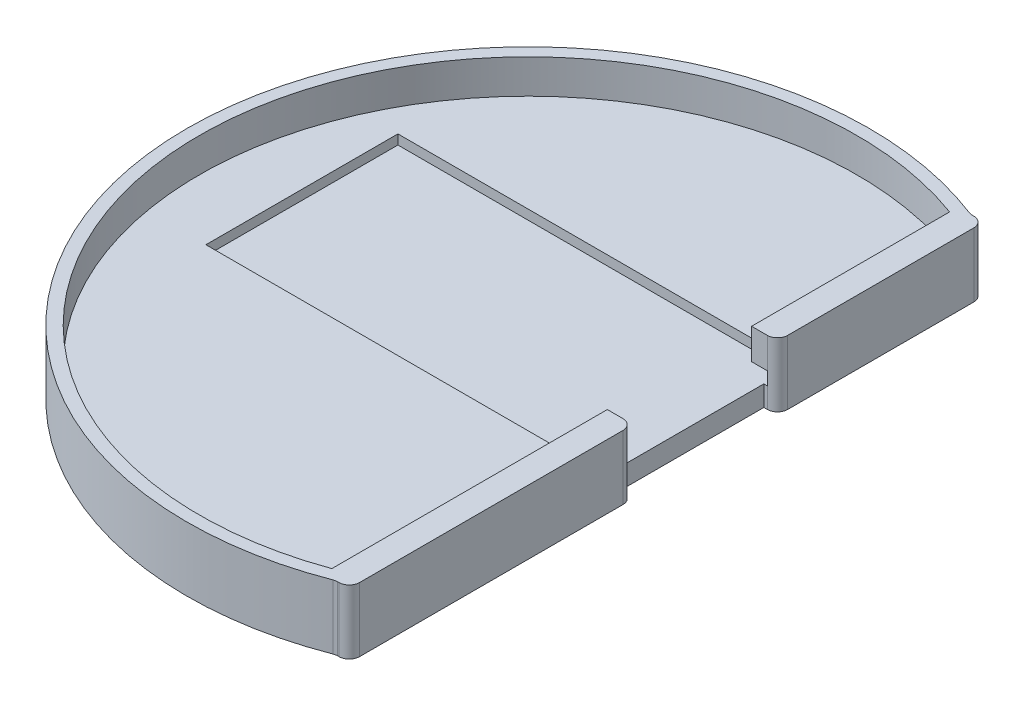
ISO-10303-21;
HEADER;
FILE_DESCRIPTION(('STEP AP214'),'2;1');
FILE_NAME('part.step','',(''),(''),'','','');
FILE_SCHEMA(('AUTOMOTIVE_DESIGN { 1 0 10303 214 1 1 1 1 }'));
ENDSEC;
DATA;
#1=APPLICATION_CONTEXT('core data for automotive mechanical design processes');
#2=APPLICATION_PROTOCOL_DEFINITION('international standard','automotive_design',2000,#1);
#3=PRODUCT_CONTEXT('',#1,'mechanical');
#4=PRODUCT('Part','Part','',(#3));
#5=PRODUCT_RELATED_PRODUCT_CATEGORY('part','',(#4));
#6=PRODUCT_DEFINITION_FORMATION('','',#4);
#7=PRODUCT_DEFINITION_CONTEXT('part definition',#1,'design');
#8=PRODUCT_DEFINITION('design','',#6,#7);
#9=PRODUCT_DEFINITION_SHAPE('','',#8);
#10=(LENGTH_UNIT() NAMED_UNIT(*) SI_UNIT(.MILLI.,.METRE.));
#11=(NAMED_UNIT(*) PLANE_ANGLE_UNIT() SI_UNIT($,.RADIAN.));
#12=(NAMED_UNIT(*) SI_UNIT($,.STERADIAN.) SOLID_ANGLE_UNIT());
#13=UNCERTAINTY_MEASURE_WITH_UNIT(LENGTH_MEASURE(1.E-05),#10,'distance_accuracy_value','');
#14=(GEOMETRIC_REPRESENTATION_CONTEXT(3) GLOBAL_UNCERTAINTY_ASSIGNED_CONTEXT((#13)) GLOBAL_UNIT_ASSIGNED_CONTEXT((#10,
#11,#12)) REPRESENTATION_CONTEXT('',''));
#15=CARTESIAN_POINT('',(0.,0.,0.));
#16=DIRECTION('',(0.,0.,1.));
#17=DIRECTION('',(1.,0.,0.));
#18=AXIS2_PLACEMENT_3D('',#15,#16,#17);
#19=CARTESIAN_POINT('',(0.,0.,-16.25));
#20=DIRECTION('',(0.,0.,1.));
#21=DIRECTION('',(1.,0.,0.));
#22=AXIS2_PLACEMENT_3D('',#19,#20,#21);
#23=PLANE('',#22);
#24=DIRECTION('',(-1.,0.,0.));
#25=VECTOR('',#24,1.);
#26=CARTESIAN_POINT('',(20.31,-1.5,-16.25));
#27=LINE('',#26,#25);
#28=CARTESIAN_POINT('',(18.81,-1.5,-16.25));
#29=VERTEX_POINT('',#28);
#30=CARTESIAN_POINT('',(18.31,-1.5,-16.25));
#31=VERTEX_POINT('',#30);
#32=EDGE_CURVE('E309',#29,#31,#27,.T.);
#33=ORIENTED_EDGE('',*,*,#32,.F.);
#34=DIRECTION('',(0.,-1.,0.));
#35=VECTOR('',#34,1.);
#36=CARTESIAN_POINT('',(18.81,0.,-16.25));
#37=LINE('',#36,#35);
#38=CARTESIAN_POINT('',(18.81,1.5,-16.25));
#39=VERTEX_POINT('',#38);
#40=EDGE_CURVE('E471',#29,#39,#37,.F.);
#41=ORIENTED_EDGE('',*,*,#40,.T.);
#42=DIRECTION('',(1.,0.,0.));
#43=VECTOR('',#42,1.);
#44=CARTESIAN_POINT('',(0.,1.5,-16.25));
#45=LINE('',#44,#43);
#46=CARTESIAN_POINT('',(18.31,1.5,-16.25));
#47=VERTEX_POINT('',#46);
#48=EDGE_CURVE('E235',#47,#39,#45,.T.);
#49=ORIENTED_EDGE('',*,*,#48,.F.);
#50=DIRECTION('',(0.,-1.,0.));
#51=VECTOR('',#50,1.);
#52=CARTESIAN_POINT('',(18.31,7.915,-16.25));
#53=LINE('',#52,#51);
#54=EDGE_CURVE('E282',#47,#31,#53,.T.);
#55=ORIENTED_EDGE('',*,*,#54,.T.);
#56=EDGE_LOOP('',(#33,#41,#49,#55));
#57=FACE_BOUND('',#56,.T.);
#58=ADVANCED_FACE('F42',(#57),#23,.T.);
#59=CARTESIAN_POINT('',(0.,0.,4.9));
#60=DIRECTION('',(0.,0.,-1.));
#61=DIRECTION('',(-1.,0.,0.));
#62=AXIS2_PLACEMENT_3D('',#59,#60,#61);
#63=PLANE('',#62);
#64=DIRECTION('',(1.,0.,0.));
#65=VECTOR('',#64,1.);
#66=CARTESIAN_POINT('',(18.31,7.915,4.9));
#67=LINE('',#66,#65);
#68=CARTESIAN_POINT('',(16.51,7.915,4.9));
#69=VERTEX_POINT('',#68);
#70=CARTESIAN_POINT('',(18.81,7.915,4.9));
#71=VERTEX_POINT('',#70);
#72=EDGE_CURVE('E320',#69,#71,#67,.T.);
#73=ORIENTED_EDGE('',*,*,#72,.T.);
#74=DIRECTION('',(0.,1.,0.));
#75=VECTOR('',#74,1.);
#76=CARTESIAN_POINT('',(18.81,-1.5,4.9));
#77=LINE('',#76,#75);
#78=CARTESIAN_POINT('',(18.81,3.415,4.9));
#79=VERTEX_POINT('',#78);
#80=EDGE_CURVE('E446',#71,#79,#77,.F.);
#81=ORIENTED_EDGE('',*,*,#80,.T.);
#82=DIRECTION('',(-1.,0.,0.));
#83=VECTOR('',#82,1.);
#84=CARTESIAN_POINT('',(18.31,3.415,4.9));
#85=LINE('',#84,#83);
#86=CARTESIAN_POINT('',(16.51,3.415,4.9));
#87=VERTEX_POINT('',#86);
#88=EDGE_CURVE('E313',#79,#87,#85,.T.);
#89=ORIENTED_EDGE('',*,*,#88,.T.);
#90=DIRECTION('',(0.,1.,0.));
#91=VECTOR('',#90,1.);
#92=CARTESIAN_POINT('',(16.51,7.915,4.9));
#93=LINE('',#92,#91);
#94=EDGE_CURVE('E316',#87,#69,#93,.T.);
#95=ORIENTED_EDGE('',*,*,#94,.T.);
#96=EDGE_LOOP('',(#73,#81,#89,#95));
#97=FACE_BOUND('',#96,.T.);
#98=ADVANCED_FACE('F529',(#97),#63,.T.);
#99=CARTESIAN_POINT('',(18.31,7.915,-46.5268084011788));
#100=DIRECTION('',(-1.,0.,0.));
#101=DIRECTION('',(0.,0.,1.));
#102=AXIS2_PLACEMENT_3D('',#99,#100,#101);
#103=PLANE('',#102);
#104=DIRECTION('',(0.,1.,0.));
#105=VECTOR('',#104,1.);
#106=CARTESIAN_POINT('',(18.31,7.915,4.9));
#107=LINE('',#106,#105);
#108=CARTESIAN_POINT('',(18.31,-1.5,4.9));
#109=VERTEX_POINT('',#108);
#110=CARTESIAN_POINT('',(18.31,1.5,4.9));
#111=VERTEX_POINT('',#110);
#112=EDGE_CURVE('E278',#109,#111,#107,.T.);
#113=ORIENTED_EDGE('',*,*,#112,.F.);
#114=DIRECTION('',(0.,0.,1.));
#115=VECTOR('',#114,1.);
#116=CARTESIAN_POINT('',(18.31,-1.5,46.5268084011788));
#117=LINE('',#116,#115);
#118=EDGE_CURVE('E346',#31,#109,#117,.T.);
#119=ORIENTED_EDGE('',*,*,#118,.F.);
#120=ORIENTED_EDGE('',*,*,#54,.F.);
#121=DIRECTION('',(0.,0.,1.));
#122=VECTOR('',#121,1.);
#123=CARTESIAN_POINT('',(18.31,1.5,0.));
#124=LINE('',#123,#122);
#125=EDGE_CURVE('E227',#47,#111,#124,.T.);
#126=ORIENTED_EDGE('',*,*,#125,.T.);
#127=EDGE_LOOP('',(#113,#119,#120,#126));
#128=FACE_BOUND('',#127,.T.);
#129=ADVANCED_FACE('F587',(#128),#103,.F.);
#130=CARTESIAN_POINT('',(-38.84,2.915,8.4));
#131=DIRECTION('',(0.,0.,-1.));
#132=DIRECTION('',(-1.,0.,0.));
#133=AXIS2_PLACEMENT_3D('',#130,#131,#132);
#134=PLANE('',#133);
#135=DIRECTION('',(0.,-1.,0.));
#136=VECTOR('',#135,1.);
#137=CARTESIAN_POINT('',(16.51,7.915,8.4));
#138=LINE('',#137,#136);
#139=CARTESIAN_POINT('',(16.51,3.415,8.4));
#140=VERTEX_POINT('',#139);
#141=CARTESIAN_POINT('',(16.51,2.915,8.4));
#142=VERTEX_POINT('',#141);
#143=EDGE_CURVE('E381',#140,#142,#138,.T.);
#144=ORIENTED_EDGE('',*,*,#143,.F.);
#145=DIRECTION('',(-1.,0.,0.));
#146=VECTOR('',#145,1.);
#147=CARTESIAN_POINT('',(18.31,3.415,8.4));
#148=LINE('',#147,#146);
#149=CARTESIAN_POINT('',(18.81,3.415,8.4));
#150=VERTEX_POINT('',#149);
#151=EDGE_CURVE('E312',#150,#140,#148,.T.);
#152=ORIENTED_EDGE('',*,*,#151,.F.);
#153=DIRECTION('',(0.,1.,0.));
#154=VECTOR('',#153,1.);
#155=CARTESIAN_POINT('',(18.81,1.5,8.4));
#156=LINE('',#155,#154);
#157=CARTESIAN_POINT('',(18.81,1.5,8.4));
#158=VERTEX_POINT('',#157);
#159=EDGE_CURVE('E240',#158,#150,#156,.T.);
#160=ORIENTED_EDGE('',*,*,#159,.F.);
#161=DIRECTION('',(-1.,0.,0.));
#162=VECTOR('',#161,1.);
#163=CARTESIAN_POINT('',(0.,1.5,8.4));
#164=LINE('',#163,#162);
#165=CARTESIAN_POINT('',(-38.84,1.5,8.4));
#166=VERTEX_POINT('',#165);
#167=EDGE_CURVE('E413',#158,#166,#164,.T.);
#168=ORIENTED_EDGE('',*,*,#167,.T.);
#169=DIRECTION('',(0.,-1.,0.));
#170=VECTOR('',#169,1.);
#171=CARTESIAN_POINT('',(-38.84,2.915,8.4));
#172=LINE('',#171,#170);
#173=CARTESIAN_POINT('',(-38.84,2.915,8.4));
#174=VERTEX_POINT('',#173);
#175=EDGE_CURVE('E403',#174,#166,#172,.T.);
#176=ORIENTED_EDGE('',*,*,#175,.F.);
#177=DIRECTION('',(1.,0.,0.));
#178=VECTOR('',#177,1.);
#179=CARTESIAN_POINT('',(-38.84,2.915,8.4));
#180=LINE('',#179,#178);
#181=EDGE_CURVE('E394',#174,#142,#180,.T.);
#182=ORIENTED_EDGE('',*,*,#181,.T.);
#183=EDGE_LOOP('',(#144,#152,#160,#168,#176,#182));
#184=FACE_BOUND('',#183,.T.);
#185=ADVANCED_FACE('F610',(#184),#134,.T.);
#186=CARTESIAN_POINT('',(-38.84,2.915,-19.75));
#187=DIRECTION('',(0.,0.,1.));
#188=DIRECTION('',(1.,0.,0.));
#189=AXIS2_PLACEMENT_3D('',#186,#187,#188);
#190=PLANE('',#189);
#191=DIRECTION('',(1.,0.,0.));
#192=VECTOR('',#191,1.);
#193=CARTESIAN_POINT('',(0.,1.5,-19.75));
#194=LINE('',#193,#192);
#195=CARTESIAN_POINT('',(-38.84,1.5,-19.75));
#196=VERTEX_POINT('',#195);
#197=CARTESIAN_POINT('',(18.81,1.5,-19.75));
#198=VERTEX_POINT('',#197);
#199=EDGE_CURVE('E216',#196,#198,#194,.T.);
#200=ORIENTED_EDGE('',*,*,#199,.T.);
#201=DIRECTION('',(0.,-1.,0.));
#202=VECTOR('',#201,1.);
#203=CARTESIAN_POINT('',(18.81,1.5,-19.75));
#204=LINE('',#203,#202);
#205=CARTESIAN_POINT('',(18.81,3.415,-19.75));
#206=VERTEX_POINT('',#205);
#207=EDGE_CURVE('E221',#206,#198,#204,.T.);
#208=ORIENTED_EDGE('',*,*,#207,.F.);
#209=DIRECTION('',(1.,0.,0.));
#210=VECTOR('',#209,1.);
#211=CARTESIAN_POINT('',(16.51,3.415,-19.75));
#212=LINE('',#211,#210);
#213=CARTESIAN_POINT('',(16.51,3.415,-19.75));
#214=VERTEX_POINT('',#213);
#215=EDGE_CURVE('E330',#214,#206,#212,.T.);
#216=ORIENTED_EDGE('',*,*,#215,.F.);
#217=DIRECTION('',(0.,-1.,0.));
#218=VECTOR('',#217,1.);
#219=CARTESIAN_POINT('',(16.51,7.915,-19.75));
#220=LINE('',#219,#218);
#221=CARTESIAN_POINT('',(16.51,2.915,-19.75));
#222=VERTEX_POINT('',#221);
#223=EDGE_CURVE('E384',#214,#222,#220,.T.);
#224=ORIENTED_EDGE('',*,*,#223,.T.);
#225=DIRECTION('',(-1.,0.,0.));
#226=VECTOR('',#225,1.);
#227=CARTESIAN_POINT('',(-38.84,2.915,-19.75));
#228=LINE('',#227,#226);
#229=CARTESIAN_POINT('',(-38.84,2.915,-19.75));
#230=VERTEX_POINT('',#229);
#231=EDGE_CURVE('E398',#222,#230,#228,.T.);
#232=ORIENTED_EDGE('',*,*,#231,.T.);
#233=DIRECTION('',(0.,-1.,0.));
#234=VECTOR('',#233,1.);
#235=CARTESIAN_POINT('',(-38.84,2.915,-19.75));
#236=LINE('',#235,#234);
#237=EDGE_CURVE('E223',#230,#196,#236,.T.);
#238=ORIENTED_EDGE('',*,*,#237,.T.);
#239=EDGE_LOOP('',(#200,#208,#216,#224,#232,#238));
#240=FACE_BOUND('',#239,.T.);
#241=ADVANCED_FACE('F218',(#240),#190,.T.);
#242=CARTESIAN_POINT('',(0.,1.5,0.));
#243=DIRECTION('',(0.,-1.,0.));
#244=DIRECTION('',(0.,0.,-1.));
#245=AXIS2_PLACEMENT_3D('',#242,#243,#244);
#246=CYLINDRICAL_SURFACE('',#245,50.);
#247=CARTESIAN_POINT('',(0.,7.915,0.));
#248=DIRECTION('',(0.,1.,0.));
#249=DIRECTION('',(0.,0.,1.));
#250=AXIS2_PLACEMENT_3D('',#247,#248,#249);
#251=CIRCLE('',#250,50.);
#252=CARTESIAN_POINT('',(18.0508303673321,7.915,-46.6279693215328));
#253=VERTEX_POINT('',#252);
#254=CARTESIAN_POINT('',(18.0508303673321,7.915,46.6279693215328));
#255=VERTEX_POINT('',#254);
#256=EDGE_CURVE('E360',#253,#255,#251,.T.);
#257=ORIENTED_EDGE('',*,*,#256,.F.);
#258=DIRECTION('',(0.,-1.,0.));
#259=VECTOR('',#258,1.);
#260=CARTESIAN_POINT('',(18.0508303673321,1.5,-46.6279693215328));
#261=LINE('',#260,#259);
#262=CARTESIAN_POINT('',(18.0508303673321,-1.5,-46.6279693215328));
#263=VERTEX_POINT('',#262);
#264=EDGE_CURVE('E483',#253,#263,#261,.T.);
#265=ORIENTED_EDGE('',*,*,#264,.T.);
#266=CARTESIAN_POINT('',(0.,-1.5,0.));
#267=DIRECTION('',(0.,1.,0.));
#268=DIRECTION('',(0.,0.,1.));
#269=AXIS2_PLACEMENT_3D('',#266,#267,#268);
#270=CIRCLE('',#269,50.);
#271=CARTESIAN_POINT('',(18.0508303673321,-1.5,46.6279693215328));
#272=VERTEX_POINT('',#271);
#273=EDGE_CURVE('E228',#263,#272,#270,.T.);
#274=ORIENTED_EDGE('',*,*,#273,.T.);
#275=DIRECTION('',(0.,-1.,0.));
#276=VECTOR('',#275,1.);
#277=CARTESIAN_POINT('',(18.0508303673321,1.5,46.6279693215328));
#278=LINE('',#277,#276);
#279=EDGE_CURVE('E480',#272,#255,#278,.F.);
#280=ORIENTED_EDGE('',*,*,#279,.T.);
#281=EDGE_LOOP('',(#257,#265,#274,#280));
#282=FACE_BOUND('',#281,.T.);
#283=ADVANCED_FACE('F504',(#282),#246,.T.);
#284=CARTESIAN_POINT('',(0.,-1.5,0.));
#285=DIRECTION('',(0.,1.,0.));
#286=DIRECTION('',(0.,0.,1.));
#287=AXIS2_PLACEMENT_3D('',#284,#285,#286);
#288=PLANE('',#287);
#289=DIRECTION('',(-1.,0.,0.));
#290=VECTOR('',#289,1.);
#291=CARTESIAN_POINT('',(20.31,-1.5,4.9));
#292=LINE('',#291,#290);
#293=CARTESIAN_POINT('',(18.81,-1.5,4.9));
#294=VERTEX_POINT('',#293);
#295=EDGE_CURVE('E274',#294,#109,#292,.T.);
#296=ORIENTED_EDGE('',*,*,#295,.F.);
#297=CARTESIAN_POINT('',(18.81,-1.5,6.4));
#298=DIRECTION('',(0.,1.,0.));
#299=DIRECTION('',(0.,0.,1.));
#300=AXIS2_PLACEMENT_3D('',#297,#298,#299);
#301=CIRCLE('',#300,1.5);
#302=CARTESIAN_POINT('',(20.31,-1.5,6.4));
#303=VERTEX_POINT('',#302);
#304=EDGE_CURVE('E457',#294,#303,#301,.F.);
#305=ORIENTED_EDGE('',*,*,#304,.T.);
#306=DIRECTION('',(0.,0.,-1.));
#307=VECTOR('',#306,1.);
#308=CARTESIAN_POINT('',(20.31,-1.5,4.9));
#309=LINE('',#308,#307);
#310=CARTESIAN_POINT('',(20.31,-1.5,45.0268084011788));
#311=VERTEX_POINT('',#310);
#312=EDGE_CURVE('E277',#311,#303,#309,.T.);
#313=ORIENTED_EDGE('',*,*,#312,.F.);
#314=CARTESIAN_POINT('',(18.8099999999999,-1.5,45.0268084011788));
#315=DIRECTION('',(0.,1.,0.));
#316=DIRECTION('',(0.,0.,1.));
#317=AXIS2_PLACEMENT_3D('',#314,#315,#316);
#318=CIRCLE('',#317,1.5);
#319=CARTESIAN_POINT('',(18.8099999999999,-1.5,46.5268084011788));
#320=VERTEX_POINT('',#319);
#321=EDGE_CURVE('E65',#311,#320,#318,.F.);
#322=ORIENTED_EDGE('',*,*,#321,.T.);
#323=DIRECTION('',(-1.,0.,0.));
#324=VECTOR('',#323,1.);
#325=CARTESIAN_POINT('',(20.31,-1.5,46.5268084011788));
#326=LINE('',#325,#324);
#327=CARTESIAN_POINT('',(18.592355278352,-1.5,46.5268084011788));
#328=VERTEX_POINT('',#327);
#329=EDGE_CURVE('E271',#320,#328,#326,.T.);
#330=ORIENTED_EDGE('',*,*,#329,.T.);
#331=CARTESIAN_POINT('',(18.592355278352,-1.5,48.0268084011788));
#332=DIRECTION('',(0.,1.,0.));
#333=DIRECTION('',(0.,0.,1.));
#334=AXIS2_PLACEMENT_3D('',#331,#332,#333);
#335=CIRCLE('',#334,1.5);
#336=EDGE_CURVE('E51',#328,#272,#335,.T.);
#337=ORIENTED_EDGE('',*,*,#336,.T.);
#338=ORIENTED_EDGE('',*,*,#273,.F.);
#339=CARTESIAN_POINT('',(18.592355278352,-1.5,-48.0268084011788));
#340=DIRECTION('',(0.,1.,0.));
#341=DIRECTION('',(0.,0.,1.));
#342=AXIS2_PLACEMENT_3D('',#339,#340,#341);
#343=CIRCLE('',#342,1.5);
#344=CARTESIAN_POINT('',(18.592355278352,-1.5,-46.5268084011788));
#345=VERTEX_POINT('',#344);
#346=EDGE_CURVE('E493',#263,#345,#343,.T.);
#347=ORIENTED_EDGE('',*,*,#346,.T.);
#348=DIRECTION('',(-1.,0.,0.));
#349=VECTOR('',#348,1.);
#350=CARTESIAN_POINT('',(20.31,-1.5,-46.5268084011788));
#351=LINE('',#350,#349);
#352=CARTESIAN_POINT('',(18.81,-1.5,-46.5268084011788));
#353=VERTEX_POINT('',#352);
#354=EDGE_CURVE('E305',#353,#345,#351,.T.);
#355=ORIENTED_EDGE('',*,*,#354,.F.);
#356=CARTESIAN_POINT('',(18.81,-1.5,-45.0268084011788));
#357=DIRECTION('',(0.,1.,0.));
#358=DIRECTION('',(0.,0.,1.));
#359=AXIS2_PLACEMENT_3D('',#356,#357,#358);
#360=CIRCLE('',#359,1.5);
#361=CARTESIAN_POINT('',(20.31,-1.5,-45.0268084011788));
#362=VERTEX_POINT('',#361);
#363=EDGE_CURVE('E451',#353,#362,#360,.F.);
#364=ORIENTED_EDGE('',*,*,#363,.T.);
#365=DIRECTION('',(0.,0.,-1.));
#366=VECTOR('',#365,1.);
#367=CARTESIAN_POINT('',(20.31,-1.5,-16.25));
#368=LINE('',#367,#366);
#369=CARTESIAN_POINT('',(20.31,-1.5,-17.75));
#370=VERTEX_POINT('',#369);
#371=EDGE_CURVE('E290',#370,#362,#368,.T.);
#372=ORIENTED_EDGE('',*,*,#371,.F.);
#373=CARTESIAN_POINT('',(18.81,-1.5,-17.75));
#374=DIRECTION('',(0.,1.,0.));
#375=DIRECTION('',(0.,0.,1.));
#376=AXIS2_PLACEMENT_3D('',#373,#374,#375);
#377=CIRCLE('',#376,1.5);
#378=EDGE_CURVE('E454',#370,#29,#377,.F.);
#379=ORIENTED_EDGE('',*,*,#378,.T.);
#380=ORIENTED_EDGE('',*,*,#32,.T.);
#381=ORIENTED_EDGE('',*,*,#118,.T.);
#382=EDGE_LOOP('',(#296,#305,#313,#322,#330,#337,#338,#347,#355,#364,#372,#379,#380,#381));
#383=FACE_BOUND('',#382,.T.);
#384=ADVANCED_FACE('F501',(#383),#288,.F.);
#385=CARTESIAN_POINT('',(0.,2.915,0.));
#386=DIRECTION('',(0.,1.,0.));
#387=DIRECTION('',(0.,0.,1.));
#388=AXIS2_PLACEMENT_3D('',#385,#386,#387);
#389=PLANE('',#388);
#390=DIRECTION('',(0.,0.,1.));
#391=VECTOR('',#390,1.);
#392=CARTESIAN_POINT('',(16.51,2.915,8.4));
#393=LINE('',#392,#391);
#394=CARTESIAN_POINT('',(16.51,2.915,45.2842124807311));
#395=VERTEX_POINT('',#394);
#396=EDGE_CURVE('E356',#142,#395,#393,.T.);
#397=ORIENTED_EDGE('',*,*,#396,.F.);
#398=ORIENTED_EDGE('',*,*,#181,.F.);
#399=DIRECTION('',(0.,0.,1.));
#400=VECTOR('',#399,1.);
#401=CARTESIAN_POINT('',(-38.84,2.915,-19.75));
#402=LINE('',#401,#400);
#403=EDGE_CURVE('E391',#230,#174,#402,.T.);
#404=ORIENTED_EDGE('',*,*,#403,.F.);
#405=ORIENTED_EDGE('',*,*,#231,.F.);
#406=DIRECTION('',(0.,0.,1.));
#407=VECTOR('',#406,1.);
#408=CARTESIAN_POINT('',(16.51,2.915,-45.2842124807311));
#409=LINE('',#408,#407);
#410=CARTESIAN_POINT('',(16.51,2.915,-45.2842124807311));
#411=VERTEX_POINT('',#410);
#412=EDGE_CURVE('E371',#411,#222,#409,.T.);
#413=ORIENTED_EDGE('',*,*,#412,.F.);
#414=CARTESIAN_POINT('',(0.,2.915,0.));
#415=DIRECTION('',(0.,-1.,0.));
#416=DIRECTION('',(0.,0.,1.));
#417=AXIS2_PLACEMENT_3D('',#414,#415,#416);
#418=CIRCLE('',#417,48.2);
#419=EDGE_CURVE('E350',#395,#411,#418,.T.);
#420=ORIENTED_EDGE('',*,*,#419,.F.);
#421=EDGE_LOOP('',(#397,#398,#404,#405,#413,#420));
#422=FACE_BOUND('',#421,.T.);
#423=ADVANCED_FACE('F624',(#422),#389,.T.);
#424=CARTESIAN_POINT('',(-38.84,2.915,-19.75));
#425=DIRECTION('',(1.,0.,0.));
#426=DIRECTION('',(0.,0.,-1.));
#427=AXIS2_PLACEMENT_3D('',#424,#425,#426);
#428=PLANE('',#427);
#429=ORIENTED_EDGE('',*,*,#175,.T.);
#430=DIRECTION('',(0.,0.,-1.));
#431=VECTOR('',#430,1.);
#432=CARTESIAN_POINT('',(-38.84,1.5,0.));
#433=LINE('',#432,#431);
#434=EDGE_CURVE('E417',#166,#196,#433,.T.);
#435=ORIENTED_EDGE('',*,*,#434,.T.);
#436=ORIENTED_EDGE('',*,*,#237,.F.);
#437=ORIENTED_EDGE('',*,*,#403,.T.);
#438=EDGE_LOOP('',(#429,#435,#436,#437));
#439=FACE_BOUND('',#438,.T.);
#440=ADVANCED_FACE('F621',(#439),#428,.T.);
#441=CARTESIAN_POINT('',(0.,1.5,0.));
#442=DIRECTION('',(0.,1.,0.));
#443=DIRECTION('',(0.,0.,1.));
#444=AXIS2_PLACEMENT_3D('',#441,#442,#443);
#445=PLANE('',#444);
#446=ORIENTED_EDGE('',*,*,#434,.F.);
#447=ORIENTED_EDGE('',*,*,#167,.F.);
#448=DIRECTION('',(0.,0.,1.));
#449=VECTOR('',#448,1.);
#450=CARTESIAN_POINT('',(18.81,1.5,-19.75));
#451=LINE('',#450,#449);
#452=CARTESIAN_POINT('',(18.81,1.5,4.9));
#453=VERTEX_POINT('',#452);
#454=EDGE_CURVE('E241',#453,#158,#451,.T.);
#455=ORIENTED_EDGE('',*,*,#454,.F.);
#456=DIRECTION('',(-1.,0.,0.));
#457=VECTOR('',#456,1.);
#458=CARTESIAN_POINT('',(0.,1.5,4.9));
#459=LINE('',#458,#457);
#460=EDGE_CURVE('E259',#453,#111,#459,.T.);
#461=ORIENTED_EDGE('',*,*,#460,.T.);
#462=ORIENTED_EDGE('',*,*,#125,.F.);
#463=ORIENTED_EDGE('',*,*,#48,.T.);
#464=EDGE_CURVE('E232',#198,#39,#451,.T.);
#465=ORIENTED_EDGE('',*,*,#464,.F.);
#466=ORIENTED_EDGE('',*,*,#199,.F.);
#467=EDGE_LOOP('',(#446,#447,#455,#461,#462,#463,#465,#466));
#468=FACE_BOUND('',#467,.T.);
#469=ADVANCED_FACE('F233',(#468),#445,.T.);
#470=CARTESIAN_POINT('',(0.,7.915,0.));
#471=DIRECTION('',(0.,-1.,0.));
#472=DIRECTION('',(0.,0.,-1.));
#473=AXIS2_PLACEMENT_3D('',#470,#471,#472);
#474=CYLINDRICAL_SURFACE('',#473,48.2);
#475=ORIENTED_EDGE('',*,*,#419,.T.);
#476=DIRECTION('',(0.,-1.,0.));
#477=VECTOR('',#476,1.);
#478=CARTESIAN_POINT('',(16.51,7.915,-45.2842124807311));
#479=LINE('',#478,#477);
#480=CARTESIAN_POINT('',(16.51,7.915,-45.2842124807311));
#481=VERTEX_POINT('',#480);
#482=EDGE_CURVE('E387',#481,#411,#479,.T.);
#483=ORIENTED_EDGE('',*,*,#482,.F.);
#484=CARTESIAN_POINT('',(0.,7.915,0.));
#485=DIRECTION('',(0.,-1.,0.));
#486=DIRECTION('',(0.,0.,1.));
#487=AXIS2_PLACEMENT_3D('',#484,#485,#486);
#488=CIRCLE('',#487,48.2);
#489=CARTESIAN_POINT('',(16.51,7.915,45.2842124807311));
#490=VERTEX_POINT('',#489);
#491=EDGE_CURVE('E351',#490,#481,#488,.T.);
#492=ORIENTED_EDGE('',*,*,#491,.F.);
#493=DIRECTION('',(0.,-1.,0.));
#494=VECTOR('',#493,1.);
#495=CARTESIAN_POINT('',(16.51,7.915,45.2842124807311));
#496=LINE('',#495,#494);
#497=EDGE_CURVE('E367',#490,#395,#496,.T.);
#498=ORIENTED_EDGE('',*,*,#497,.T.);
#499=EDGE_LOOP('',(#475,#483,#492,#498));
#500=FACE_BOUND('',#499,.T.);
#501=ADVANCED_FACE('F542',(#500),#474,.F.);
#502=CARTESIAN_POINT('',(16.51,7.915,-45.2842124807311));
#503=DIRECTION('',(1.,0.,0.));
#504=DIRECTION('',(0.,0.,-1.));
#505=AXIS2_PLACEMENT_3D('',#502,#503,#504);
#506=PLANE('',#505);
#507=ORIENTED_EDGE('',*,*,#412,.T.);
#508=ORIENTED_EDGE('',*,*,#223,.F.);
#509=DIRECTION('',(0.,0.,-1.));
#510=VECTOR('',#509,1.);
#511=CARTESIAN_POINT('',(16.51,3.415,-16.25));
#512=LINE('',#511,#510);
#513=CARTESIAN_POINT('',(16.51,3.415,-16.25));
#514=VERTEX_POINT('',#513);
#515=EDGE_CURVE('E341',#514,#214,#512,.T.);
#516=ORIENTED_EDGE('',*,*,#515,.F.);
#517=DIRECTION('',(0.,-1.,0.));
#518=VECTOR('',#517,1.);
#519=CARTESIAN_POINT('',(16.51,7.915,-16.25));
#520=LINE('',#519,#518);
#521=CARTESIAN_POINT('',(16.51,7.915,-16.25));
#522=VERTEX_POINT('',#521);
#523=EDGE_CURVE('E331',#522,#514,#520,.T.);
#524=ORIENTED_EDGE('',*,*,#523,.F.);
#525=DIRECTION('',(0.,0.,1.));
#526=VECTOR('',#525,1.);
#527=CARTESIAN_POINT('',(16.51,7.915,-45.2842124807311));
#528=LINE('',#527,#526);
#529=EDGE_CURVE('E355',#481,#522,#528,.T.);
#530=ORIENTED_EDGE('',*,*,#529,.F.);
#531=ORIENTED_EDGE('',*,*,#482,.T.);
#532=EDGE_LOOP('',(#507,#508,#516,#524,#530,#531));
#533=FACE_BOUND('',#532,.T.);
#534=ADVANCED_FACE('F544',(#533),#506,.F.);
#535=CARTESIAN_POINT('',(16.51,7.915,8.4));
#536=DIRECTION('',(1.,0.,0.));
#537=DIRECTION('',(0.,0.,-1.));
#538=AXIS2_PLACEMENT_3D('',#535,#536,#537);
#539=PLANE('',#538);
#540=ORIENTED_EDGE('',*,*,#396,.T.);
#541=ORIENTED_EDGE('',*,*,#497,.F.);
#542=DIRECTION('',(0.,0.,1.));
#543=VECTOR('',#542,1.);
#544=CARTESIAN_POINT('',(16.51,7.915,8.4));
#545=LINE('',#544,#543);
#546=EDGE_CURVE('E364',#69,#490,#545,.T.);
#547=ORIENTED_EDGE('',*,*,#546,.F.);
#548=ORIENTED_EDGE('',*,*,#94,.F.);
#549=DIRECTION('',(0.,0.,1.));
#550=VECTOR('',#549,1.);
#551=CARTESIAN_POINT('',(16.51,3.415,4.9));
#552=LINE('',#551,#550);
#553=EDGE_CURVE('E324',#87,#140,#552,.T.);
#554=ORIENTED_EDGE('',*,*,#553,.T.);
#555=ORIENTED_EDGE('',*,*,#143,.T.);
#556=EDGE_LOOP('',(#540,#541,#547,#548,#554,#555));
#557=FACE_BOUND('',#556,.T.);
#558=ADVANCED_FACE('F534',(#557),#539,.F.);
#559=CARTESIAN_POINT('',(0.,7.915,0.));
#560=DIRECTION('',(0.,1.,0.));
#561=DIRECTION('',(0.,0.,1.));
#562=AXIS2_PLACEMENT_3D('',#559,#560,#561);
#563=PLANE('',#562);
#564=DIRECTION('',(0.,0.,1.));
#565=VECTOR('',#564,1.);
#566=CARTESIAN_POINT('',(20.31,7.915,4.9));
#567=LINE('',#566,#565);
#568=CARTESIAN_POINT('',(20.31,7.915,6.4));
#569=VERTEX_POINT('',#568);
#570=CARTESIAN_POINT('',(20.31,7.915,45.0268084011788));
#571=VERTEX_POINT('',#570);
#572=EDGE_CURVE('E283',#569,#571,#567,.T.);
#573=ORIENTED_EDGE('',*,*,#572,.F.);
#574=CARTESIAN_POINT('',(18.81,7.915,6.4));
#575=DIRECTION('',(0.,1.,0.));
#576=DIRECTION('',(0.,0.,1.));
#577=AXIS2_PLACEMENT_3D('',#574,#575,#576);
#578=CIRCLE('',#577,1.5);
#579=EDGE_CURVE('E440',#569,#71,#578,.T.);
#580=ORIENTED_EDGE('',*,*,#579,.T.);
#581=ORIENTED_EDGE('',*,*,#72,.F.);
#582=ORIENTED_EDGE('',*,*,#546,.T.);
#583=ORIENTED_EDGE('',*,*,#491,.T.);
#584=ORIENTED_EDGE('',*,*,#529,.T.);
#585=DIRECTION('',(-1.,0.,0.));
#586=VECTOR('',#585,1.);
#587=CARTESIAN_POINT('',(16.51,7.915,-16.25));
#588=LINE('',#587,#586);
#589=CARTESIAN_POINT('',(18.81,7.915,-16.25));
#590=VERTEX_POINT('',#589);
#591=EDGE_CURVE('E338',#590,#522,#588,.T.);
#592=ORIENTED_EDGE('',*,*,#591,.F.);
#593=CARTESIAN_POINT('',(18.81,7.915,-17.75));
#594=DIRECTION('',(0.,1.,0.));
#595=DIRECTION('',(0.,0.,1.));
#596=AXIS2_PLACEMENT_3D('',#593,#594,#595);
#597=CIRCLE('',#596,1.5);
#598=CARTESIAN_POINT('',(20.31,7.915,-17.75));
#599=VERTEX_POINT('',#598);
#600=EDGE_CURVE('E437',#590,#599,#597,.T.);
#601=ORIENTED_EDGE('',*,*,#600,.T.);
#602=DIRECTION('',(0.,0.,1.));
#603=VECTOR('',#602,1.);
#604=CARTESIAN_POINT('',(20.31,7.915,-16.25));
#605=LINE('',#604,#603);
#606=CARTESIAN_POINT('',(20.31,7.915,-45.0268084011788));
#607=VERTEX_POINT('',#606);
#608=EDGE_CURVE('E294',#607,#599,#605,.T.);
#609=ORIENTED_EDGE('',*,*,#608,.F.);
#610=CARTESIAN_POINT('',(18.81,7.915,-45.0268084011788));
#611=DIRECTION('',(0.,1.,0.));
#612=DIRECTION('',(0.,0.,1.));
#613=AXIS2_PLACEMENT_3D('',#610,#611,#612);
#614=CIRCLE('',#613,1.5);
#615=CARTESIAN_POINT('',(18.81,7.915,-46.5268084011788));
#616=VERTEX_POINT('',#615);
#617=EDGE_CURVE('E434',#607,#616,#614,.T.);
#618=ORIENTED_EDGE('',*,*,#617,.T.);
#619=DIRECTION('',(-1.,0.,0.));
#620=VECTOR('',#619,1.);
#621=CARTESIAN_POINT('',(20.31,7.915,-46.5268084011788));
#622=LINE('',#621,#620);
#623=CARTESIAN_POINT('',(18.592355278352,7.915,-46.5268084011788));
#624=VERTEX_POINT('',#623);
#625=EDGE_CURVE('E298',#616,#624,#622,.T.);
#626=ORIENTED_EDGE('',*,*,#625,.T.);
#627=CARTESIAN_POINT('',(18.592355278352,7.915,-48.0268084011788));
#628=DIRECTION('',(0.,1.,0.));
#629=DIRECTION('',(0.,0.,1.));
#630=AXIS2_PLACEMENT_3D('',#627,#628,#629);
#631=CIRCLE('',#630,1.5);
#632=EDGE_CURVE('E496',#624,#253,#631,.F.);
#633=ORIENTED_EDGE('',*,*,#632,.T.);
#634=ORIENTED_EDGE('',*,*,#256,.T.);
#635=CARTESIAN_POINT('',(18.592355278352,7.915,48.0268084011788));
#636=DIRECTION('',(0.,1.,0.));
#637=DIRECTION('',(0.,0.,1.));
#638=AXIS2_PLACEMENT_3D('',#635,#636,#637);
#639=CIRCLE('',#638,1.5);
#640=CARTESIAN_POINT('',(18.592355278352,7.915,46.5268084011788));
#641=VERTEX_POINT('',#640);
#642=EDGE_CURVE('E11',#255,#641,#639,.F.);
#643=ORIENTED_EDGE('',*,*,#642,.T.);
#644=DIRECTION('',(-1.,0.,0.));
#645=VECTOR('',#644,1.);
#646=CARTESIAN_POINT('',(20.31,7.915,46.5268084011788));
#647=LINE('',#646,#645);
#648=CARTESIAN_POINT('',(18.8099999999999,7.915,46.5268084011788));
#649=VERTEX_POINT('',#648);
#650=EDGE_CURVE('E267',#649,#641,#647,.T.);
#651=ORIENTED_EDGE('',*,*,#650,.F.);
#652=CARTESIAN_POINT('',(18.8099999999999,7.915,45.0268084011788));
#653=DIRECTION('',(0.,1.,0.));
#654=DIRECTION('',(0.,0.,1.));
#655=AXIS2_PLACEMENT_3D('',#652,#653,#654);
#656=CIRCLE('',#655,1.5);
#657=EDGE_CURVE('E431',#649,#571,#656,.T.);
#658=ORIENTED_EDGE('',*,*,#657,.T.);
#659=EDGE_LOOP('',(#573,#580,#581,#582,#583,#584,#592,#601,#609,#618,#626,#633,#634,#643,#651,#658));
#660=FACE_BOUND('',#659,.T.);
#661=ADVANCED_FACE('F510',(#660),#563,.T.);
#662=CARTESIAN_POINT('',(16.51,3.415,-16.25));
#663=DIRECTION('',(0.,1.,0.));
#664=DIRECTION('',(0.,0.,1.));
#665=AXIS2_PLACEMENT_3D('',#662,#663,#664);
#666=PLANE('',#665);
#667=ORIENTED_EDGE('',*,*,#215,.T.);
#668=DIRECTION('',(0.,0.,-1.));
#669=VECTOR('',#668,1.);
#670=CARTESIAN_POINT('',(18.81,3.415,-19.75));
#671=LINE('',#670,#669);
#672=CARTESIAN_POINT('',(18.81,3.415,-16.25));
#673=VERTEX_POINT('',#672);
#674=EDGE_CURVE('E246',#673,#206,#671,.T.);
#675=ORIENTED_EDGE('',*,*,#674,.F.);
#676=DIRECTION('',(1.,0.,0.));
#677=VECTOR('',#676,1.);
#678=CARTESIAN_POINT('',(16.51,3.415,-16.25));
#679=LINE('',#678,#677);
#680=EDGE_CURVE('E335',#514,#673,#679,.T.);
#681=ORIENTED_EDGE('',*,*,#680,.F.);
#682=ORIENTED_EDGE('',*,*,#515,.T.);
#683=EDGE_LOOP('',(#667,#675,#681,#682));
#684=FACE_BOUND('',#683,.T.);
#685=ADVANCED_FACE('F594',(#684),#666,.F.);
#686=ORIENTED_EDGE('',*,*,#680,.T.);
#687=DIRECTION('',(0.,-1.,0.));
#688=VECTOR('',#687,1.);
#689=CARTESIAN_POINT('',(18.81,0.,-16.25));
#690=LINE('',#689,#688);
#691=EDGE_CURVE('E468',#673,#590,#690,.F.);
#692=ORIENTED_EDGE('',*,*,#691,.T.);
#693=ORIENTED_EDGE('',*,*,#591,.T.);
#694=ORIENTED_EDGE('',*,*,#523,.T.);
#695=EDGE_LOOP('',(#686,#692,#693,#694));
#696=FACE_BOUND('',#695,.T.);
#697=ADVANCED_FACE('F548',(#696),#23,.T.);
#698=CARTESIAN_POINT('',(18.31,3.415,4.9));
#699=DIRECTION('',(0.,1.,0.));
#700=DIRECTION('',(0.,0.,1.));
#701=AXIS2_PLACEMENT_3D('',#698,#699,#700);
#702=PLANE('',#701);
#703=ORIENTED_EDGE('',*,*,#151,.T.);
#704=ORIENTED_EDGE('',*,*,#553,.F.);
#705=ORIENTED_EDGE('',*,*,#88,.F.);
#706=EDGE_CURVE('E255',#150,#79,#671,.T.);
#707=ORIENTED_EDGE('',*,*,#706,.F.);
#708=EDGE_LOOP('',(#703,#704,#705,#707));
#709=FACE_BOUND('',#708,.T.);
#710=ADVANCED_FACE('F593',(#709),#702,.F.);
#711=ORIENTED_EDGE('',*,*,#460,.F.);
#712=DIRECTION('',(0.,1.,0.));
#713=VECTOR('',#712,1.);
#714=CARTESIAN_POINT('',(18.81,-1.5,4.9));
#715=LINE('',#714,#713);
#716=EDGE_CURVE('E443',#453,#294,#715,.F.);
#717=ORIENTED_EDGE('',*,*,#716,.T.);
#718=ORIENTED_EDGE('',*,*,#295,.T.);
#719=ORIENTED_EDGE('',*,*,#112,.T.);
#720=EDGE_LOOP('',(#711,#717,#718,#719));
#721=FACE_BOUND('',#720,.T.);
#722=ADVANCED_FACE('F589',(#721),#63,.T.);
#723=CARTESIAN_POINT('',(20.31,7.915,-46.5268084011788));
#724=DIRECTION('',(0.,0.,1.));
#725=DIRECTION('',(1.,0.,0.));
#726=AXIS2_PLACEMENT_3D('',#723,#724,#725);
#727=PLANE('',#726);
#728=ORIENTED_EDGE('',*,*,#625,.F.);
#729=DIRECTION('',(0.,1.,0.));
#730=VECTOR('',#729,1.);
#731=CARTESIAN_POINT('',(18.81,-1.5,-46.5268084011788));
#732=LINE('',#731,#730);
#733=EDGE_CURVE('E477',#616,#353,#732,.F.);
#734=ORIENTED_EDGE('',*,*,#733,.T.);
#735=ORIENTED_EDGE('',*,*,#354,.T.);
#736=DIRECTION('',(0.,1.,0.));
#737=VECTOR('',#736,1.);
#738=CARTESIAN_POINT('',(18.592355278352,7.915,-46.5268084011788));
#739=LINE('',#738,#737);
#740=EDGE_CURVE('E474',#345,#624,#739,.T.);
#741=ORIENTED_EDGE('',*,*,#740,.T.);
#742=EDGE_LOOP('',(#728,#734,#735,#741));
#743=FACE_BOUND('',#742,.T.);
#744=ADVANCED_FACE('F569',(#743),#727,.F.);
#745=CARTESIAN_POINT('',(20.31,0.,0.));
#746=DIRECTION('',(1.,0.,0.));
#747=DIRECTION('',(0.,0.,-1.));
#748=AXIS2_PLACEMENT_3D('',#745,#746,#747);
#749=PLANE('',#748);
#750=ORIENTED_EDGE('',*,*,#608,.T.);
#751=DIRECTION('',(0.,-1.,0.));
#752=VECTOR('',#751,1.);
#753=CARTESIAN_POINT('',(20.31,0.,-17.75));
#754=LINE('',#753,#752);
#755=EDGE_CURVE('E464',#599,#370,#754,.T.);
#756=ORIENTED_EDGE('',*,*,#755,.T.);
#757=ORIENTED_EDGE('',*,*,#371,.T.);
#758=DIRECTION('',(0.,1.,0.));
#759=VECTOR('',#758,1.);
#760=CARTESIAN_POINT('',(20.31,7.915,-45.0268084011788));
#761=LINE('',#760,#759);
#762=EDGE_CURVE('E460',#362,#607,#761,.T.);
#763=ORIENTED_EDGE('',*,*,#762,.T.);
#764=EDGE_LOOP('',(#750,#756,#757,#763));
#765=FACE_BOUND('',#764,.T.);
#766=ADVANCED_FACE('F558',(#765),#749,.T.);
#767=CARTESIAN_POINT('',(20.31,7.915,46.5268084011788));
#768=DIRECTION('',(0.,0.,-1.));
#769=DIRECTION('',(-1.,0.,0.));
#770=AXIS2_PLACEMENT_3D('',#767,#768,#769);
#771=PLANE('',#770);
#772=ORIENTED_EDGE('',*,*,#329,.F.);
#773=DIRECTION('',(0.,-1.,0.));
#774=VECTOR('',#773,1.);
#775=CARTESIAN_POINT('',(18.8099999999999,7.915,46.5268084011788));
#776=LINE('',#775,#774);
#777=EDGE_CURVE('E490',#320,#649,#776,.F.);
#778=ORIENTED_EDGE('',*,*,#777,.T.);
#779=ORIENTED_EDGE('',*,*,#650,.T.);
#780=DIRECTION('',(0.,1.,0.));
#781=VECTOR('',#780,1.);
#782=CARTESIAN_POINT('',(18.592355278352,-1.5,46.5268084011788));
#783=LINE('',#782,#781);
#784=EDGE_CURVE('E487',#641,#328,#783,.F.);
#785=ORIENTED_EDGE('',*,*,#784,.T.);
#786=EDGE_LOOP('',(#772,#778,#779,#785));
#787=FACE_BOUND('',#786,.T.);
#788=ADVANCED_FACE('F513',(#787),#771,.F.);
#789=CARTESIAN_POINT('',(20.31,0.,0.));
#790=DIRECTION('',(-1.,0.,0.));
#791=DIRECTION('',(0.,0.,1.));
#792=AXIS2_PLACEMENT_3D('',#789,#790,#791);
#793=PLANE('',#792);
#794=ORIENTED_EDGE('',*,*,#312,.T.);
#795=DIRECTION('',(0.,1.,0.));
#796=VECTOR('',#795,1.);
#797=CARTESIAN_POINT('',(20.31,7.915,6.4));
#798=LINE('',#797,#796);
#799=EDGE_CURVE('E427',#303,#569,#798,.T.);
#800=ORIENTED_EDGE('',*,*,#799,.T.);
#801=ORIENTED_EDGE('',*,*,#572,.T.);
#802=DIRECTION('',(0.,-1.,0.));
#803=VECTOR('',#802,1.);
#804=CARTESIAN_POINT('',(20.3099999999999,0.,45.0268084011788));
#805=LINE('',#804,#803);
#806=EDGE_CURVE('E423',#571,#311,#805,.T.);
#807=ORIENTED_EDGE('',*,*,#806,.T.);
#808=EDGE_LOOP('',(#794,#800,#801,#807));
#809=FACE_BOUND('',#808,.T.);
#810=ADVANCED_FACE('F519',(#809),#793,.F.);
#811=CARTESIAN_POINT('',(18.81,0.,0.));
#812=DIRECTION('',(1.,0.,0.));
#813=DIRECTION('',(0.,0.,-1.));
#814=AXIS2_PLACEMENT_3D('',#811,#812,#813);
#815=PLANE('',#814);
#816=DIRECTION('',(0.,-1.,0.));
#817=VECTOR('',#816,1.);
#818=CARTESIAN_POINT('',(18.81,0.,4.9));
#819=LINE('',#818,#817);
#820=EDGE_CURVE('E420',#79,#453,#819,.T.);
#821=ORIENTED_EDGE('',*,*,#820,.T.);
#822=ORIENTED_EDGE('',*,*,#454,.T.);
#823=ORIENTED_EDGE('',*,*,#159,.T.);
#824=ORIENTED_EDGE('',*,*,#706,.T.);
#825=EDGE_LOOP('',(#821,#822,#823,#824));
#826=FACE_BOUND('',#825,.T.);
#827=ADVANCED_FACE('F702',(#826),#815,.F.);
#828=DIRECTION('',(0.,1.,0.));
#829=VECTOR('',#828,1.);
#830=CARTESIAN_POINT('',(18.81,0.,-16.25));
#831=LINE('',#830,#829);
#832=EDGE_CURVE('E264',#39,#673,#831,.T.);
#833=ORIENTED_EDGE('',*,*,#832,.T.);
#834=ORIENTED_EDGE('',*,*,#674,.T.);
#835=ORIENTED_EDGE('',*,*,#207,.T.);
#836=ORIENTED_EDGE('',*,*,#464,.T.);
#837=EDGE_LOOP('',(#833,#834,#835,#836));
#838=FACE_BOUND('',#837,.T.);
#839=ADVANCED_FACE('F244',(#838),#815,.F.);
#840=CARTESIAN_POINT('',(18.81,0.,6.4));
#841=DIRECTION('',(0.,-1.,0.));
#842=DIRECTION('',(0.,0.,-1.));
#843=AXIS2_PLACEMENT_3D('',#840,#841,#842);
#844=CYLINDRICAL_SURFACE('',#843,1.5);
#845=ORIENTED_EDGE('',*,*,#820,.F.);
#846=ORIENTED_EDGE('',*,*,#80,.F.);
#847=ORIENTED_EDGE('',*,*,#579,.F.);
#848=ORIENTED_EDGE('',*,*,#799,.F.);
#849=ORIENTED_EDGE('',*,*,#304,.F.);
#850=ORIENTED_EDGE('',*,*,#716,.F.);
#851=EDGE_LOOP('',(#845,#846,#847,#848,#849,#850));
#852=FACE_BOUND('',#851,.T.);
#853=ADVANCED_FACE('F524',(#852),#844,.T.);
#854=CARTESIAN_POINT('',(18.81,0.,-17.75));
#855=DIRECTION('',(0.,-1.,0.));
#856=DIRECTION('',(0.,0.,-1.));
#857=AXIS2_PLACEMENT_3D('',#854,#855,#856);
#858=CYLINDRICAL_SURFACE('',#857,1.5);
#859=ORIENTED_EDGE('',*,*,#832,.F.);
#860=ORIENTED_EDGE('',*,*,#40,.F.);
#861=ORIENTED_EDGE('',*,*,#378,.F.);
#862=ORIENTED_EDGE('',*,*,#755,.F.);
#863=ORIENTED_EDGE('',*,*,#600,.F.);
#864=ORIENTED_EDGE('',*,*,#691,.F.);
#865=EDGE_LOOP('',(#859,#860,#861,#862,#863,#864));
#866=FACE_BOUND('',#865,.T.);
#867=ADVANCED_FACE('F554',(#866),#858,.T.);
#868=CARTESIAN_POINT('',(18.81,0.,-45.0268084011788));
#869=DIRECTION('',(0.,-1.,0.));
#870=DIRECTION('',(0.,0.,-1.));
#871=AXIS2_PLACEMENT_3D('',#868,#869,#870);
#872=CYLINDRICAL_SURFACE('',#871,1.5);
#873=ORIENTED_EDGE('',*,*,#363,.F.);
#874=ORIENTED_EDGE('',*,*,#733,.F.);
#875=ORIENTED_EDGE('',*,*,#617,.F.);
#876=ORIENTED_EDGE('',*,*,#762,.F.);
#877=EDGE_LOOP('',(#873,#874,#875,#876));
#878=FACE_BOUND('',#877,.T.);
#879=ADVANCED_FACE('F565',(#878),#872,.T.);
#880=CARTESIAN_POINT('',(18.592355278352,1.5,-48.0268084011788));
#881=DIRECTION('',(0.,-1.,0.));
#882=DIRECTION('',(0.,0.,-1.));
#883=AXIS2_PLACEMENT_3D('',#880,#881,#882);
#884=CYLINDRICAL_SURFACE('',#883,1.5);
#885=ORIENTED_EDGE('',*,*,#632,.F.);
#886=ORIENTED_EDGE('',*,*,#740,.F.);
#887=ORIENTED_EDGE('',*,*,#346,.F.);
#888=ORIENTED_EDGE('',*,*,#264,.F.);
#889=EDGE_LOOP('',(#885,#886,#887,#888));
#890=FACE_BOUND('',#889,.T.);
#891=ADVANCED_FACE('F572',(#890),#884,.F.);
#892=CARTESIAN_POINT('',(18.8099999999999,0.,45.0268084011788));
#893=DIRECTION('',(0.,-1.,0.));
#894=DIRECTION('',(0.,0.,-1.));
#895=AXIS2_PLACEMENT_3D('',#892,#893,#894);
#896=CYLINDRICAL_SURFACE('',#895,1.5);
#897=ORIENTED_EDGE('',*,*,#657,.F.);
#898=ORIENTED_EDGE('',*,*,#777,.F.);
#899=ORIENTED_EDGE('',*,*,#321,.F.);
#900=ORIENTED_EDGE('',*,*,#806,.F.);
#901=EDGE_LOOP('',(#897,#898,#899,#900));
#902=FACE_BOUND('',#901,.T.);
#903=ADVANCED_FACE('F516',(#902),#896,.T.);
#904=CARTESIAN_POINT('',(18.592355278352,1.5,48.0268084011788));
#905=DIRECTION('',(0.,-1.,0.));
#906=DIRECTION('',(0.,0.,-1.));
#907=AXIS2_PLACEMENT_3D('',#904,#905,#906);
#908=CYLINDRICAL_SURFACE('',#907,1.5);
#909=ORIENTED_EDGE('',*,*,#642,.F.);
#910=ORIENTED_EDGE('',*,*,#279,.F.);
#911=ORIENTED_EDGE('',*,*,#336,.F.);
#912=ORIENTED_EDGE('',*,*,#784,.F.);
#913=EDGE_LOOP('',(#909,#910,#911,#912));
#914=FACE_BOUND('',#913,.T.);
#915=ADVANCED_FACE('F44',(#914),#908,.F.);
#916=CLOSED_SHELL('',(#58,#98,#129,#185,#241,#283,#384,#423,#440,#469,#501,#534,#558,#661,#685,
#697,#710,#722,#744,#766,#788,#810,#827,#839,#853,#867,#879,#891,#903,#915));
#917=MANIFOLD_SOLID_BREP('B2',#916);
#918=ADVANCED_BREP_SHAPE_REPRESENTATION('',(#18,#917),#14);
#919=SHAPE_DEFINITION_REPRESENTATION(#9,#918);
ENDSEC;
END-ISO-10303-21;
